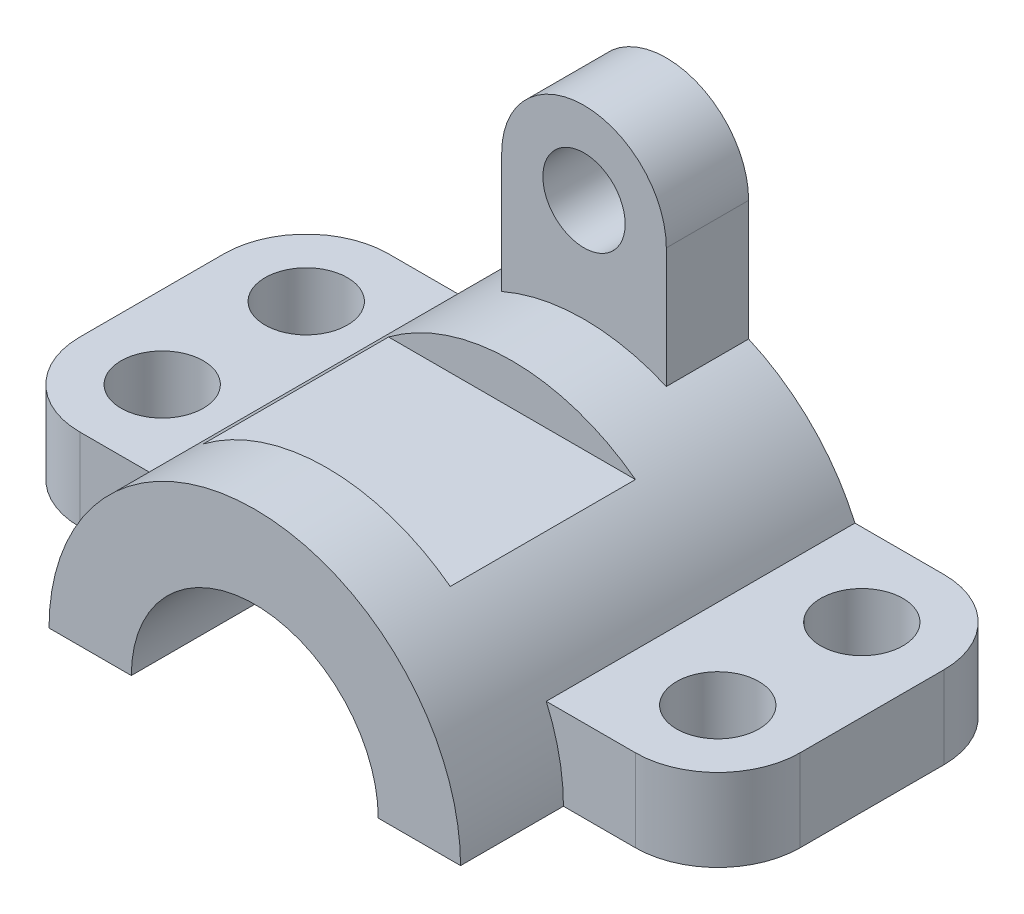
ISO-10303-21;
HEADER;
FILE_DESCRIPTION(('STEP AP214'),'2;1');
FILE_NAME('part.step','',(''),(''),'','','');
FILE_SCHEMA(('AUTOMOTIVE_DESIGN { 1 0 10303 214 1 1 1 1 }'));
ENDSEC;
DATA;
#1=APPLICATION_CONTEXT('core data for automotive mechanical design processes');
#2=APPLICATION_PROTOCOL_DEFINITION('international standard','automotive_design',2000,#1);
#3=PRODUCT_CONTEXT('',#1,'mechanical');
#4=PRODUCT('Part','Part','',(#3));
#5=PRODUCT_RELATED_PRODUCT_CATEGORY('part','',(#4));
#6=PRODUCT_DEFINITION_FORMATION('','',#4);
#7=PRODUCT_DEFINITION_CONTEXT('part definition',#1,'design');
#8=PRODUCT_DEFINITION('design','',#6,#7);
#9=PRODUCT_DEFINITION_SHAPE('','',#8);
#10=(LENGTH_UNIT() NAMED_UNIT(*) SI_UNIT(.MILLI.,.METRE.));
#11=(NAMED_UNIT(*) PLANE_ANGLE_UNIT() SI_UNIT($,.RADIAN.));
#12=(NAMED_UNIT(*) SI_UNIT($,.STERADIAN.) SOLID_ANGLE_UNIT());
#13=UNCERTAINTY_MEASURE_WITH_UNIT(LENGTH_MEASURE(1.E-05),#10,'distance_accuracy_value','');
#14=(GEOMETRIC_REPRESENTATION_CONTEXT(3) GLOBAL_UNCERTAINTY_ASSIGNED_CONTEXT((#13)) GLOBAL_UNIT_ASSIGNED_CONTEXT((#10,
#11,#12)) REPRESENTATION_CONTEXT('',''));
#15=CARTESIAN_POINT('',(0.,0.,0.));
#16=DIRECTION('',(0.,0.,1.));
#17=DIRECTION('',(1.,0.,0.));
#18=AXIS2_PLACEMENT_3D('',#15,#16,#17);
#19=CARTESIAN_POINT('',(0.,0.,80.));
#20=DIRECTION('',(0.,0.,-1.));
#21=DIRECTION('',(-1.,0.,0.));
#22=AXIS2_PLACEMENT_3D('',#19,#20,#21);
#23=CYLINDRICAL_SURFACE('',#22,40.);
#24=DIRECTION('',(0.,0.,-1.));
#25=VECTOR('',#24,1.);
#26=CARTESIAN_POINT('',(24.,32.,80.));
#27=LINE('',#26,#25);
#28=CARTESIAN_POINT('',(24.,32.,66.));
#29=VERTEX_POINT('',#28);
#30=CARTESIAN_POINT('',(24.,32.,30.));
#31=VERTEX_POINT('',#30);
#32=EDGE_CURVE('E42',#29,#31,#27,.T.);
#33=ORIENTED_EDGE('',*,*,#32,.F.);
#34=CARTESIAN_POINT('',(0.,0.,66.));
#35=DIRECTION('',(0.,0.,-1.));
#36=DIRECTION('',(-1.,0.,0.));
#37=AXIS2_PLACEMENT_3D('',#34,#35,#36);
#38=CIRCLE('',#37,40.);
#39=CARTESIAN_POINT('',(-24.,32.,66.));
#40=VERTEX_POINT('',#39);
#41=EDGE_CURVE('E336',#40,#29,#38,.T.);
#42=ORIENTED_EDGE('',*,*,#41,.F.);
#43=DIRECTION('',(0.,0.,-1.));
#44=VECTOR('',#43,1.);
#45=CARTESIAN_POINT('',(-24.,32.,80.));
#46=LINE('',#45,#44);
#47=CARTESIAN_POINT('',(-24.,32.,30.));
#48=VERTEX_POINT('',#47);
#49=EDGE_CURVE('E331',#48,#40,#46,.F.);
#50=ORIENTED_EDGE('',*,*,#49,.F.);
#51=CARTESIAN_POINT('',(0.,0.,30.));
#52=DIRECTION('',(0.,0.,1.));
#53=DIRECTION('',(1.,0.,0.));
#54=AXIS2_PLACEMENT_3D('',#51,#52,#53);
#55=CIRCLE('',#54,40.);
#56=EDGE_CURVE('E333',#31,#48,#55,.T.);
#57=ORIENTED_EDGE('',*,*,#56,.F.);
#58=EDGE_LOOP('',(#33,#42,#50,#57));
#59=FACE_BOUND('',#58,.T.);
#60=DIRECTION('',(0.,0.,-1.));
#61=VECTOR('',#60,1.);
#62=CARTESIAN_POINT('',(-16.,36.6606055596467,16.));
#63=LINE('',#62,#61);
#64=CARTESIAN_POINT('',(-16.,36.6606055596467,16.));
#65=VERTEX_POINT('',#64);
#66=CARTESIAN_POINT('',(-16.,36.6606055596467,0.));
#67=VERTEX_POINT('',#66);
#68=EDGE_CURVE('E174',#65,#67,#63,.T.);
#69=ORIENTED_EDGE('',*,*,#68,.T.);
#70=CARTESIAN_POINT('',(0.,0.,0.));
#71=DIRECTION('',(0.,0.,1.));
#72=DIRECTION('',(1.,0.,0.));
#73=AXIS2_PLACEMENT_3D('',#70,#71,#72);
#74=CIRCLE('',#73,40.);
#75=CARTESIAN_POINT('',(-36.6606055596467,16.,0.));
#76=VERTEX_POINT('',#75);
#77=EDGE_CURVE('E302',#67,#76,#74,.T.);
#78=ORIENTED_EDGE('',*,*,#77,.T.);
#79=DIRECTION('',(0.,0.,-1.));
#80=VECTOR('',#79,1.);
#81=CARTESIAN_POINT('',(-36.6606055596467,16.,80.));
#82=LINE('',#81,#80);
#83=CARTESIAN_POINT('',(-36.6606055596467,16.,60.));
#84=VERTEX_POINT('',#83);
#85=EDGE_CURVE('E246',#84,#76,#82,.T.);
#86=ORIENTED_EDGE('',*,*,#85,.F.);
#87=CARTESIAN_POINT('',(0.,0.,60.));
#88=DIRECTION('',(0.,0.,-1.));
#89=DIRECTION('',(-1.,0.,0.));
#90=AXIS2_PLACEMENT_3D('',#87,#88,#89);
#91=CIRCLE('',#90,40.);
#92=CARTESIAN_POINT('',(-40.,0.,60.));
#93=VERTEX_POINT('',#92);
#94=EDGE_CURVE('E249',#93,#84,#91,.T.);
#95=ORIENTED_EDGE('',*,*,#94,.F.);
#96=DIRECTION('',(0.,0.,-1.));
#97=VECTOR('',#96,1.);
#98=CARTESIAN_POINT('',(-40.,0.,80.));
#99=LINE('',#98,#97);
#100=CARTESIAN_POINT('',(-40.,0.,80.));
#101=VERTEX_POINT('',#100);
#102=EDGE_CURVE('E328',#101,#93,#99,.T.);
#103=ORIENTED_EDGE('',*,*,#102,.F.);
#104=CARTESIAN_POINT('',(0.,0.,80.));
#105=DIRECTION('',(0.,0.,1.));
#106=DIRECTION('',(1.,0.,0.));
#107=AXIS2_PLACEMENT_3D('',#104,#105,#106);
#108=CIRCLE('',#107,40.);
#109=CARTESIAN_POINT('',(40.,0.,80.));
#110=VERTEX_POINT('',#109);
#111=EDGE_CURVE('E303',#110,#101,#108,.T.);
#112=ORIENTED_EDGE('',*,*,#111,.F.);
#113=DIRECTION('',(0.,0.,-1.));
#114=VECTOR('',#113,1.);
#115=CARTESIAN_POINT('',(40.,0.,80.));
#116=LINE('',#115,#114);
#117=CARTESIAN_POINT('',(40.,0.,60.));
#118=VERTEX_POINT('',#117);
#119=EDGE_CURVE('E313',#110,#118,#116,.T.);
#120=ORIENTED_EDGE('',*,*,#119,.T.);
#121=CARTESIAN_POINT('',(0.,0.,60.));
#122=DIRECTION('',(0.,0.,-1.));
#123=DIRECTION('',(-1.,0.,0.));
#124=AXIS2_PLACEMENT_3D('',#121,#122,#123);
#125=CIRCLE('',#124,40.);
#126=CARTESIAN_POINT('',(36.6606055596467,16.,60.));
#127=VERTEX_POINT('',#126);
#128=EDGE_CURVE('E299',#127,#118,#125,.T.);
#129=ORIENTED_EDGE('',*,*,#128,.F.);
#130=DIRECTION('',(0.,0.,-1.));
#131=VECTOR('',#130,1.);
#132=CARTESIAN_POINT('',(36.6606055596467,16.,80.));
#133=LINE('',#132,#131);
#134=CARTESIAN_POINT('',(36.6606055596467,16.,0.));
#135=VERTEX_POINT('',#134);
#136=EDGE_CURVE('E296',#127,#135,#133,.T.);
#137=ORIENTED_EDGE('',*,*,#136,.T.);
#138=CARTESIAN_POINT('',(16.,36.6606055596467,0.));
#139=VERTEX_POINT('',#138);
#140=EDGE_CURVE('E314',#135,#139,#74,.T.);
#141=ORIENTED_EDGE('',*,*,#140,.T.);
#142=DIRECTION('',(0.,0.,-1.));
#143=VECTOR('',#142,1.);
#144=CARTESIAN_POINT('',(16.,36.6606055596467,16.));
#145=LINE('',#144,#143);
#146=CARTESIAN_POINT('',(16.,36.6606055596467,16.));
#147=VERTEX_POINT('',#146);
#148=EDGE_CURVE('E52',#147,#139,#145,.T.);
#149=ORIENTED_EDGE('',*,*,#148,.F.);
#150=CARTESIAN_POINT('',(0.,0.,16.));
#151=DIRECTION('',(0.,0.,1.));
#152=DIRECTION('',(1.,0.,0.));
#153=AXIS2_PLACEMENT_3D('',#150,#151,#152);
#154=CIRCLE('',#153,40.);
#155=EDGE_CURVE('E11',#147,#65,#154,.T.);
#156=ORIENTED_EDGE('',*,*,#155,.T.);
#157=EDGE_LOOP('',(#69,#78,#86,#95,#103,#112,#120,#129,#137,#141,#149,#156));
#158=FACE_BOUND('',#157,.T.);
#159=ADVANCED_FACE('F35',(#59,#158),#23,.T.);
#160=CARTESIAN_POINT('',(-40.,0.,80.));
#161=DIRECTION('',(0.,1.,0.));
#162=DIRECTION('',(0.,0.,1.));
#163=AXIS2_PLACEMENT_3D('',#160,#161,#162);
#164=PLANE('',#163);
#165=ORIENTED_EDGE('',*,*,#102,.T.);
#166=DIRECTION('',(1.,0.,0.));
#167=VECTOR('',#166,1.);
#168=CARTESIAN_POINT('',(-53.9999999999999,0.,60.));
#169=LINE('',#168,#167);
#170=CARTESIAN_POINT('',(-53.9999999999999,0.,60.));
#171=VERTEX_POINT('',#170);
#172=EDGE_CURVE('E217',#171,#93,#169,.T.);
#173=ORIENTED_EDGE('',*,*,#172,.F.);
#174=CARTESIAN_POINT('',(-54.,0.,44.));
#175=DIRECTION('',(0.,1.,0.));
#176=DIRECTION('',(0.,0.,1.));
#177=AXIS2_PLACEMENT_3D('',#174,#175,#176);
#178=CIRCLE('',#177,16.);
#179=CARTESIAN_POINT('',(-70.,0.,43.9999999999999));
#180=VERTEX_POINT('',#179);
#181=EDGE_CURVE('E231',#180,#171,#178,.T.);
#182=ORIENTED_EDGE('',*,*,#181,.F.);
#183=DIRECTION('',(0.,0.,1.));
#184=VECTOR('',#183,1.);
#185=CARTESIAN_POINT('',(-70.,0.,16.0000000000001));
#186=LINE('',#185,#184);
#187=CARTESIAN_POINT('',(-70.,0.,16.0000000000001));
#188=VERTEX_POINT('',#187);
#189=EDGE_CURVE('E229',#188,#180,#186,.T.);
#190=ORIENTED_EDGE('',*,*,#189,.F.);
#191=CARTESIAN_POINT('',(-54.,0.,16.));
#192=DIRECTION('',(0.,1.,0.));
#193=DIRECTION('',(0.,0.,-1.));
#194=AXIS2_PLACEMENT_3D('',#191,#192,#193);
#195=CIRCLE('',#194,16.);
#196=CARTESIAN_POINT('',(-53.9999999999999,0.,0.));
#197=VERTEX_POINT('',#196);
#198=EDGE_CURVE('E210',#197,#188,#195,.T.);
#199=ORIENTED_EDGE('',*,*,#198,.F.);
#200=DIRECTION('',(1.,0.,0.));
#201=VECTOR('',#200,1.);
#202=CARTESIAN_POINT('',(-40.,0.,0.));
#203=LINE('',#202,#201);
#204=CARTESIAN_POINT('',(-24.,0.,0.));
#205=VERTEX_POINT('',#204);
#206=EDGE_CURVE('E316',#197,#205,#203,.T.);
#207=ORIENTED_EDGE('',*,*,#206,.T.);
#208=DIRECTION('',(0.,0.,-1.));
#209=VECTOR('',#208,1.);
#210=CARTESIAN_POINT('',(-24.,0.,80.));
#211=LINE('',#210,#209);
#212=CARTESIAN_POINT('',(-24.,0.,80.));
#213=VERTEX_POINT('',#212);
#214=EDGE_CURVE('E325',#213,#205,#211,.T.);
#215=ORIENTED_EDGE('',*,*,#214,.F.);
#216=DIRECTION('',(1.,0.,0.));
#217=VECTOR('',#216,1.);
#218=CARTESIAN_POINT('',(-40.,0.,80.));
#219=LINE('',#218,#217);
#220=EDGE_CURVE('E306',#101,#213,#219,.T.);
#221=ORIENTED_EDGE('',*,*,#220,.F.);
#222=EDGE_LOOP('',(#165,#173,#182,#190,#199,#207,#215,#221));
#223=FACE_BOUND('',#222,.T.);
#224=CARTESIAN_POINT('',(-54.,0.,16.));
#225=DIRECTION('',(0.,1.,0.));
#226=DIRECTION('',(0.,0.,-1.));
#227=AXIS2_PLACEMENT_3D('',#224,#225,#226);
#228=CIRCLE('',#227,8.);
#229=CARTESIAN_POINT('',(-54.,0.,8.00000000000001));
#230=VERTEX_POINT('',#229);
#231=EDGE_CURVE('E200',#230,#230,#228,.T.);
#232=ORIENTED_EDGE('',*,*,#231,.T.);
#233=EDGE_LOOP('',(#232));
#234=FACE_BOUND('',#233,.T.);
#235=CARTESIAN_POINT('',(-54.,0.,44.));
#236=DIRECTION('',(0.,1.,0.));
#237=DIRECTION('',(0.,0.,-1.));
#238=AXIS2_PLACEMENT_3D('',#235,#236,#237);
#239=CIRCLE('',#238,8.);
#240=CARTESIAN_POINT('',(-54.,0.,36.));
#241=VERTEX_POINT('',#240);
#242=EDGE_CURVE('E204',#241,#241,#239,.T.);
#243=ORIENTED_EDGE('',*,*,#242,.T.);
#244=EDGE_LOOP('',(#243));
#245=FACE_BOUND('',#244,.T.);
#246=ADVANCED_FACE('F363',(#223,#234,#245),#164,.F.);
#247=CARTESIAN_POINT('',(0.,0.,80.));
#248=DIRECTION('',(0.,0.,-1.));
#249=DIRECTION('',(-1.,0.,0.));
#250=AXIS2_PLACEMENT_3D('',#247,#248,#249);
#251=CYLINDRICAL_SURFACE('',#250,24.);
#252=CARTESIAN_POINT('',(0.,0.,0.));
#253=DIRECTION('',(0.,0.,-1.));
#254=DIRECTION('',(1.,0.,0.));
#255=AXIS2_PLACEMENT_3D('',#252,#253,#254);
#256=CIRCLE('',#255,24.);
#257=CARTESIAN_POINT('',(24.,0.,0.));
#258=VERTEX_POINT('',#257);
#259=EDGE_CURVE('E318',#205,#258,#256,.T.);
#260=ORIENTED_EDGE('',*,*,#259,.T.);
#261=DIRECTION('',(0.,0.,-1.));
#262=VECTOR('',#261,1.);
#263=CARTESIAN_POINT('',(24.,0.,80.));
#264=LINE('',#263,#262);
#265=CARTESIAN_POINT('',(24.,0.,80.));
#266=VERTEX_POINT('',#265);
#267=EDGE_CURVE('E322',#266,#258,#264,.T.);
#268=ORIENTED_EDGE('',*,*,#267,.F.);
#269=CARTESIAN_POINT('',(0.,0.,80.));
#270=DIRECTION('',(0.,0.,-1.));
#271=DIRECTION('',(1.,0.,0.));
#272=AXIS2_PLACEMENT_3D('',#269,#270,#271);
#273=CIRCLE('',#272,24.);
#274=EDGE_CURVE('E309',#213,#266,#273,.T.);
#275=ORIENTED_EDGE('',*,*,#274,.F.);
#276=ORIENTED_EDGE('',*,*,#214,.T.);
#277=EDGE_LOOP('',(#260,#268,#275,#276));
#278=FACE_BOUND('',#277,.T.);
#279=ADVANCED_FACE('F369',(#278),#251,.F.);
#280=CARTESIAN_POINT('',(24.,0.,80.));
#281=DIRECTION('',(0.,1.,0.));
#282=DIRECTION('',(0.,0.,1.));
#283=AXIS2_PLACEMENT_3D('',#280,#281,#282);
#284=PLANE('',#283);
#285=DIRECTION('',(1.,0.,0.));
#286=VECTOR('',#285,1.);
#287=CARTESIAN_POINT('',(24.,0.,0.));
#288=LINE('',#287,#286);
#289=CARTESIAN_POINT('',(53.9999999999999,0.,0.));
#290=VERTEX_POINT('',#289);
#291=EDGE_CURVE('E307',#258,#290,#288,.T.);
#292=ORIENTED_EDGE('',*,*,#291,.T.);
#293=CARTESIAN_POINT('',(54.,0.,16.));
#294=DIRECTION('',(0.,1.,0.));
#295=DIRECTION('',(0.,0.,1.));
#296=AXIS2_PLACEMENT_3D('',#293,#294,#295);
#297=CIRCLE('',#296,16.);
#298=CARTESIAN_POINT('',(70.,0.,16.0000000000001));
#299=VERTEX_POINT('',#298);
#300=EDGE_CURVE('E268',#299,#290,#297,.T.);
#301=ORIENTED_EDGE('',*,*,#300,.F.);
#302=DIRECTION('',(0.,0.,-1.));
#303=VECTOR('',#302,1.);
#304=CARTESIAN_POINT('',(70.,0.,16.0000000000001));
#305=LINE('',#304,#303);
#306=CARTESIAN_POINT('',(70.,0.,43.9999999999999));
#307=VERTEX_POINT('',#306);
#308=EDGE_CURVE('E281',#307,#299,#305,.T.);
#309=ORIENTED_EDGE('',*,*,#308,.F.);
#310=CARTESIAN_POINT('',(54.,0.,44.));
#311=DIRECTION('',(0.,1.,0.));
#312=DIRECTION('',(0.,0.,-1.));
#313=AXIS2_PLACEMENT_3D('',#310,#311,#312);
#314=CIRCLE('',#313,16.);
#315=CARTESIAN_POINT('',(53.9999999999999,0.,60.));
#316=VERTEX_POINT('',#315);
#317=EDGE_CURVE('E279',#316,#307,#314,.T.);
#318=ORIENTED_EDGE('',*,*,#317,.F.);
#319=DIRECTION('',(1.,0.,0.));
#320=VECTOR('',#319,1.);
#321=CARTESIAN_POINT('',(53.9999999999999,0.,60.));
#322=LINE('',#321,#320);
#323=EDGE_CURVE('E262',#118,#316,#322,.T.);
#324=ORIENTED_EDGE('',*,*,#323,.F.);
#325=ORIENTED_EDGE('',*,*,#119,.F.);
#326=DIRECTION('',(1.,0.,0.));
#327=VECTOR('',#326,1.);
#328=CARTESIAN_POINT('',(24.,0.,80.));
#329=LINE('',#328,#327);
#330=EDGE_CURVE('E311',#266,#110,#329,.T.);
#331=ORIENTED_EDGE('',*,*,#330,.F.);
#332=ORIENTED_EDGE('',*,*,#267,.T.);
#333=EDGE_LOOP('',(#292,#301,#309,#318,#324,#325,#331,#332));
#334=FACE_BOUND('',#333,.T.);
#335=CARTESIAN_POINT('',(54.,0.,16.));
#336=DIRECTION('',(0.,1.,0.));
#337=DIRECTION('',(0.,0.,1.));
#338=AXIS2_PLACEMENT_3D('',#335,#336,#337);
#339=CIRCLE('',#338,8.);
#340=CARTESIAN_POINT('',(54.,0.,24.));
#341=VERTEX_POINT('',#340);
#342=EDGE_CURVE('E256',#341,#341,#339,.T.);
#343=ORIENTED_EDGE('',*,*,#342,.T.);
#344=EDGE_LOOP('',(#343));
#345=FACE_BOUND('',#344,.T.);
#346=CARTESIAN_POINT('',(54.,0.,44.));
#347=DIRECTION('',(0.,1.,0.));
#348=DIRECTION('',(0.,0.,1.));
#349=AXIS2_PLACEMENT_3D('',#346,#347,#348);
#350=CIRCLE('',#349,8.);
#351=CARTESIAN_POINT('',(54.,0.,52.));
#352=VERTEX_POINT('',#351);
#353=EDGE_CURVE('E252',#352,#352,#350,.T.);
#354=ORIENTED_EDGE('',*,*,#353,.T.);
#355=EDGE_LOOP('',(#354));
#356=FACE_BOUND('',#355,.T.);
#357=ADVANCED_FACE('F374',(#334,#345,#356),#284,.F.);
#358=CARTESIAN_POINT('',(0.,0.,80.));
#359=DIRECTION('',(0.,0.,1.));
#360=DIRECTION('',(1.,0.,0.));
#361=AXIS2_PLACEMENT_3D('',#358,#359,#360);
#362=PLANE('',#361);
#363=ORIENTED_EDGE('',*,*,#111,.T.);
#364=ORIENTED_EDGE('',*,*,#220,.T.);
#365=ORIENTED_EDGE('',*,*,#274,.T.);
#366=ORIENTED_EDGE('',*,*,#330,.T.);
#367=EDGE_LOOP('',(#363,#364,#365,#366));
#368=FACE_BOUND('',#367,.T.);
#369=ADVANCED_FACE('F381',(#368),#362,.T.);
#370=CARTESIAN_POINT('',(0.,0.,0.));
#371=DIRECTION('',(0.,0.,1.));
#372=DIRECTION('',(1.,0.,0.));
#373=AXIS2_PLACEMENT_3D('',#370,#371,#372);
#374=PLANE('',#373);
#375=ORIENTED_EDGE('',*,*,#77,.F.);
#376=DIRECTION('',(0.,-1.,0.));
#377=VECTOR('',#376,1.);
#378=CARTESIAN_POINT('',(-16.,60.,0.));
#379=LINE('',#378,#377);
#380=CARTESIAN_POINT('',(-16.,60.,0.));
#381=VERTEX_POINT('',#380);
#382=EDGE_CURVE('E482',#381,#67,#379,.T.);
#383=ORIENTED_EDGE('',*,*,#382,.F.);
#384=CARTESIAN_POINT('',(0.,60.,0.));
#385=DIRECTION('',(0.,0.,1.));
#386=DIRECTION('',(1.,0.,0.));
#387=AXIS2_PLACEMENT_3D('',#384,#385,#386);
#388=CIRCLE('',#387,16.);
#389=CARTESIAN_POINT('',(16.,60.,0.));
#390=VERTEX_POINT('',#389);
#391=EDGE_CURVE('E190',#390,#381,#388,.T.);
#392=ORIENTED_EDGE('',*,*,#391,.F.);
#393=DIRECTION('',(0.,1.,0.));
#394=VECTOR('',#393,1.);
#395=CARTESIAN_POINT('',(16.,60.,0.));
#396=LINE('',#395,#394);
#397=EDGE_CURVE('E186',#139,#390,#396,.T.);
#398=ORIENTED_EDGE('',*,*,#397,.F.);
#399=ORIENTED_EDGE('',*,*,#140,.F.);
#400=DIRECTION('',(-1.,0.,0.));
#401=VECTOR('',#400,1.);
#402=CARTESIAN_POINT('',(32.9517303575973,16.,0.));
#403=LINE('',#402,#401);
#404=CARTESIAN_POINT('',(53.9999999999999,16.,0.));
#405=VERTEX_POINT('',#404);
#406=EDGE_CURVE('E274',#405,#135,#403,.T.);
#407=ORIENTED_EDGE('',*,*,#406,.F.);
#408=DIRECTION('',(0.,-1.,0.));
#409=VECTOR('',#408,1.);
#410=CARTESIAN_POINT('',(53.9999999999999,16.,0.));
#411=LINE('',#410,#409);
#412=EDGE_CURVE('E277',#405,#290,#411,.T.);
#413=ORIENTED_EDGE('',*,*,#412,.T.);
#414=ORIENTED_EDGE('',*,*,#291,.F.);
#415=ORIENTED_EDGE('',*,*,#259,.F.);
#416=ORIENTED_EDGE('',*,*,#206,.F.);
#417=DIRECTION('',(0.,-1.,0.));
#418=VECTOR('',#417,1.);
#419=CARTESIAN_POINT('',(-53.9999999999999,16.,0.));
#420=LINE('',#419,#418);
#421=CARTESIAN_POINT('',(-53.9999999999999,16.,0.));
#422=VERTEX_POINT('',#421);
#423=EDGE_CURVE('E226',#422,#197,#420,.T.);
#424=ORIENTED_EDGE('',*,*,#423,.F.);
#425=DIRECTION('',(-1.,0.,0.));
#426=VECTOR('',#425,1.);
#427=CARTESIAN_POINT('',(-32.9517303575973,16.,0.));
#428=LINE('',#427,#426);
#429=EDGE_CURVE('E224',#76,#422,#428,.T.);
#430=ORIENTED_EDGE('',*,*,#429,.F.);
#431=EDGE_LOOP('',(#375,#383,#392,#398,#399,#407,#413,#414,#415,#416,#424,#430));
#432=FACE_BOUND('',#431,.T.);
#433=CARTESIAN_POINT('',(0.,60.,0.));
#434=DIRECTION('',(0.,0.,1.));
#435=DIRECTION('',(1.,0.,0.));
#436=AXIS2_PLACEMENT_3D('',#433,#434,#435);
#437=CIRCLE('',#436,8.);
#438=CARTESIAN_POINT('',(8.,60.,0.));
#439=VERTEX_POINT('',#438);
#440=EDGE_CURVE('E490',#439,#439,#437,.T.);
#441=ORIENTED_EDGE('',*,*,#440,.T.);
#442=EDGE_LOOP('',(#441));
#443=FACE_BOUND('',#442,.T.);
#444=ADVANCED_FACE('F383',(#432,#443),#374,.F.);
#445=CARTESIAN_POINT('',(53.9999999999999,16.,60.));
#446=DIRECTION('',(0.,0.,-1.));
#447=DIRECTION('',(-1.,0.,0.));
#448=AXIS2_PLACEMENT_3D('',#445,#446,#447);
#449=PLANE('',#448);
#450=DIRECTION('',(1.,0.,0.));
#451=VECTOR('',#450,1.);
#452=CARTESIAN_POINT('',(53.9999999999999,16.,60.));
#453=LINE('',#452,#451);
#454=CARTESIAN_POINT('',(53.9999999999999,16.,60.));
#455=VERTEX_POINT('',#454);
#456=EDGE_CURVE('E265',#127,#455,#453,.T.);
#457=ORIENTED_EDGE('',*,*,#456,.F.);
#458=ORIENTED_EDGE('',*,*,#128,.T.);
#459=ORIENTED_EDGE('',*,*,#323,.T.);
#460=DIRECTION('',(0.,-1.,0.));
#461=VECTOR('',#460,1.);
#462=CARTESIAN_POINT('',(53.9999999999999,16.,60.));
#463=LINE('',#462,#461);
#464=EDGE_CURVE('E293',#455,#316,#463,.T.);
#465=ORIENTED_EDGE('',*,*,#464,.F.);
#466=EDGE_LOOP('',(#457,#458,#459,#465));
#467=FACE_BOUND('',#466,.T.);
#468=ADVANCED_FACE('F385',(#467),#449,.F.);
#469=CARTESIAN_POINT('',(54.,16.,16.));
#470=DIRECTION('',(0.,1.,0.));
#471=DIRECTION('',(0.,0.,1.));
#472=AXIS2_PLACEMENT_3D('',#469,#470,#471);
#473=PLANE('',#472);
#474=CARTESIAN_POINT('',(54.,16.,44.));
#475=DIRECTION('',(0.,1.,0.));
#476=DIRECTION('',(0.,0.,1.));
#477=AXIS2_PLACEMENT_3D('',#474,#475,#476);
#478=CIRCLE('',#477,8.);
#479=CARTESIAN_POINT('',(54.,16.,52.));
#480=VERTEX_POINT('',#479);
#481=EDGE_CURVE('E253',#480,#480,#478,.T.);
#482=ORIENTED_EDGE('',*,*,#481,.F.);
#483=EDGE_LOOP('',(#482));
#484=FACE_BOUND('',#483,.T.);
#485=CARTESIAN_POINT('',(54.,16.,16.));
#486=DIRECTION('',(0.,1.,0.));
#487=DIRECTION('',(0.,0.,1.));
#488=AXIS2_PLACEMENT_3D('',#485,#486,#487);
#489=CIRCLE('',#488,8.);
#490=CARTESIAN_POINT('',(54.,16.,24.));
#491=VERTEX_POINT('',#490);
#492=EDGE_CURVE('E259',#491,#491,#489,.T.);
#493=ORIENTED_EDGE('',*,*,#492,.F.);
#494=EDGE_LOOP('',(#493));
#495=FACE_BOUND('',#494,.T.);
#496=ORIENTED_EDGE('',*,*,#136,.F.);
#497=ORIENTED_EDGE('',*,*,#456,.T.);
#498=CARTESIAN_POINT('',(54.,16.,44.));
#499=DIRECTION('',(0.,1.,0.));
#500=DIRECTION('',(0.,0.,-1.));
#501=AXIS2_PLACEMENT_3D('',#498,#499,#500);
#502=CIRCLE('',#501,16.);
#503=CARTESIAN_POINT('',(70.,16.,43.9999999999999));
#504=VERTEX_POINT('',#503);
#505=EDGE_CURVE('E267',#455,#504,#502,.T.);
#506=ORIENTED_EDGE('',*,*,#505,.T.);
#507=DIRECTION('',(0.,0.,-1.));
#508=VECTOR('',#507,1.);
#509=CARTESIAN_POINT('',(70.,16.,16.0000000000001));
#510=LINE('',#509,#508);
#511=CARTESIAN_POINT('',(70.,16.,16.0000000000001));
#512=VERTEX_POINT('',#511);
#513=EDGE_CURVE('E270',#504,#512,#510,.T.);
#514=ORIENTED_EDGE('',*,*,#513,.T.);
#515=CARTESIAN_POINT('',(54.,16.,16.));
#516=DIRECTION('',(0.,1.,0.));
#517=DIRECTION('',(0.,0.,1.));
#518=AXIS2_PLACEMENT_3D('',#515,#516,#517);
#519=CIRCLE('',#518,16.);
#520=EDGE_CURVE('E272',#512,#405,#519,.T.);
#521=ORIENTED_EDGE('',*,*,#520,.T.);
#522=ORIENTED_EDGE('',*,*,#406,.T.);
#523=EDGE_LOOP('',(#496,#497,#506,#514,#521,#522));
#524=FACE_BOUND('',#523,.T.);
#525=ADVANCED_FACE('F392',(#484,#495,#524),#473,.T.);
#526=CARTESIAN_POINT('',(54.,16.,44.));
#527=DIRECTION('',(0.,-1.,0.));
#528=DIRECTION('',(0.,0.,-1.));
#529=AXIS2_PLACEMENT_3D('',#526,#527,#528);
#530=CYLINDRICAL_SURFACE('',#529,16.);
#531=ORIENTED_EDGE('',*,*,#317,.T.);
#532=DIRECTION('',(0.,-1.,0.));
#533=VECTOR('',#532,1.);
#534=CARTESIAN_POINT('',(70.,16.,43.9999999999999));
#535=LINE('',#534,#533);
#536=EDGE_CURVE('E290',#504,#307,#535,.T.);
#537=ORIENTED_EDGE('',*,*,#536,.F.);
#538=ORIENTED_EDGE('',*,*,#505,.F.);
#539=ORIENTED_EDGE('',*,*,#464,.T.);
#540=EDGE_LOOP('',(#531,#537,#538,#539));
#541=FACE_BOUND('',#540,.T.);
#542=ADVANCED_FACE('F394',(#541),#530,.T.);
#543=CARTESIAN_POINT('',(70.,16.,16.0000000000001));
#544=DIRECTION('',(-1.,0.,0.));
#545=DIRECTION('',(0.,0.,1.));
#546=AXIS2_PLACEMENT_3D('',#543,#544,#545);
#547=PLANE('',#546);
#548=ORIENTED_EDGE('',*,*,#308,.T.);
#549=DIRECTION('',(0.,-1.,0.));
#550=VECTOR('',#549,1.);
#551=CARTESIAN_POINT('',(70.,16.,16.0000000000001));
#552=LINE('',#551,#550);
#553=EDGE_CURVE('E287',#512,#299,#552,.T.);
#554=ORIENTED_EDGE('',*,*,#553,.F.);
#555=ORIENTED_EDGE('',*,*,#513,.F.);
#556=ORIENTED_EDGE('',*,*,#536,.T.);
#557=EDGE_LOOP('',(#548,#554,#555,#556));
#558=FACE_BOUND('',#557,.T.);
#559=ADVANCED_FACE('F397',(#558),#547,.F.);
#560=CARTESIAN_POINT('',(54.,16.,16.));
#561=DIRECTION('',(0.,-1.,0.));
#562=DIRECTION('',(0.,0.,-1.));
#563=AXIS2_PLACEMENT_3D('',#560,#561,#562);
#564=CYLINDRICAL_SURFACE('',#563,16.);
#565=ORIENTED_EDGE('',*,*,#300,.T.);
#566=ORIENTED_EDGE('',*,*,#412,.F.);
#567=ORIENTED_EDGE('',*,*,#520,.F.);
#568=ORIENTED_EDGE('',*,*,#553,.T.);
#569=EDGE_LOOP('',(#565,#566,#567,#568));
#570=FACE_BOUND('',#569,.T.);
#571=ADVANCED_FACE('F401',(#570),#564,.T.);
#572=CARTESIAN_POINT('',(54.,16.,16.));
#573=DIRECTION('',(0.,-1.,0.));
#574=DIRECTION('',(0.,0.,-1.));
#575=AXIS2_PLACEMENT_3D('',#572,#573,#574);
#576=CYLINDRICAL_SURFACE('',#575,8.);
#577=ORIENTED_EDGE('',*,*,#492,.T.);
#578=EDGE_LOOP('',(#577));
#579=FACE_BOUND('',#578,.T.);
#580=ORIENTED_EDGE('',*,*,#342,.F.);
#581=EDGE_LOOP('',(#580));
#582=FACE_BOUND('',#581,.T.);
#583=ADVANCED_FACE('F405',(#579,#582),#576,.F.);
#584=CARTESIAN_POINT('',(54.,16.,44.));
#585=DIRECTION('',(0.,-1.,0.));
#586=DIRECTION('',(0.,0.,-1.));
#587=AXIS2_PLACEMENT_3D('',#584,#585,#586);
#588=CYLINDRICAL_SURFACE('',#587,8.);
#589=ORIENTED_EDGE('',*,*,#481,.T.);
#590=EDGE_LOOP('',(#589));
#591=FACE_BOUND('',#590,.T.);
#592=ORIENTED_EDGE('',*,*,#353,.F.);
#593=EDGE_LOOP('',(#592));
#594=FACE_BOUND('',#593,.T.);
#595=ADVANCED_FACE('F412',(#591,#594),#588,.F.);
#596=CARTESIAN_POINT('',(-53.9999999999999,16.,60.));
#597=DIRECTION('',(0.,0.,-1.));
#598=DIRECTION('',(-1.,0.,0.));
#599=AXIS2_PLACEMENT_3D('',#596,#597,#598);
#600=PLANE('',#599);
#601=ORIENTED_EDGE('',*,*,#172,.T.);
#602=ORIENTED_EDGE('',*,*,#94,.T.);
#603=DIRECTION('',(1.,0.,0.));
#604=VECTOR('',#603,1.);
#605=CARTESIAN_POINT('',(-53.9999999999999,16.,60.));
#606=LINE('',#605,#604);
#607=CARTESIAN_POINT('',(-53.9999999999999,16.,60.));
#608=VERTEX_POINT('',#607);
#609=EDGE_CURVE('E221',#608,#84,#606,.T.);
#610=ORIENTED_EDGE('',*,*,#609,.F.);
#611=DIRECTION('',(0.,-1.,0.));
#612=VECTOR('',#611,1.);
#613=CARTESIAN_POINT('',(-53.9999999999999,16.,60.));
#614=LINE('',#613,#612);
#615=EDGE_CURVE('E237',#608,#171,#614,.T.);
#616=ORIENTED_EDGE('',*,*,#615,.T.);
#617=EDGE_LOOP('',(#601,#602,#610,#616));
#618=FACE_BOUND('',#617,.T.);
#619=ADVANCED_FACE('F416',(#618),#600,.F.);
#620=CARTESIAN_POINT('',(-54.,16.,16.));
#621=DIRECTION('',(0.,-1.,0.));
#622=DIRECTION('',(0.,0.,-1.));
#623=AXIS2_PLACEMENT_3D('',#620,#621,#622);
#624=PLANE('',#623);
#625=CARTESIAN_POINT('',(-54.,16.,44.));
#626=DIRECTION('',(0.,1.,0.));
#627=DIRECTION('',(0.,0.,-1.));
#628=AXIS2_PLACEMENT_3D('',#625,#626,#627);
#629=CIRCLE('',#628,8.);
#630=CARTESIAN_POINT('',(-54.,16.,36.));
#631=VERTEX_POINT('',#630);
#632=EDGE_CURVE('E207',#631,#631,#629,.T.);
#633=ORIENTED_EDGE('',*,*,#632,.F.);
#634=EDGE_LOOP('',(#633));
#635=FACE_BOUND('',#634,.T.);
#636=CARTESIAN_POINT('',(-54.,16.,16.));
#637=DIRECTION('',(0.,1.,0.));
#638=DIRECTION('',(0.,0.,-1.));
#639=AXIS2_PLACEMENT_3D('',#636,#637,#638);
#640=CIRCLE('',#639,8.);
#641=CARTESIAN_POINT('',(-54.,16.,8.00000000000001));
#642=VERTEX_POINT('',#641);
#643=EDGE_CURVE('E201',#642,#642,#640,.T.);
#644=ORIENTED_EDGE('',*,*,#643,.F.);
#645=EDGE_LOOP('',(#644));
#646=FACE_BOUND('',#645,.T.);
#647=ORIENTED_EDGE('',*,*,#609,.T.);
#648=ORIENTED_EDGE('',*,*,#85,.T.);
#649=ORIENTED_EDGE('',*,*,#429,.T.);
#650=CARTESIAN_POINT('',(-54.,16.,16.));
#651=DIRECTION('',(0.,1.,0.));
#652=DIRECTION('',(0.,0.,-1.));
#653=AXIS2_PLACEMENT_3D('',#650,#651,#652);
#654=CIRCLE('',#653,16.);
#655=CARTESIAN_POINT('',(-70.,16.,16.0000000000001));
#656=VERTEX_POINT('',#655);
#657=EDGE_CURVE('E213',#422,#656,#654,.T.);
#658=ORIENTED_EDGE('',*,*,#657,.T.);
#659=DIRECTION('',(0.,0.,1.));
#660=VECTOR('',#659,1.);
#661=CARTESIAN_POINT('',(-70.,16.,16.0000000000001));
#662=LINE('',#661,#660);
#663=CARTESIAN_POINT('',(-70.,16.,43.9999999999999));
#664=VERTEX_POINT('',#663);
#665=EDGE_CURVE('E216',#656,#664,#662,.T.);
#666=ORIENTED_EDGE('',*,*,#665,.T.);
#667=CARTESIAN_POINT('',(-54.,16.,44.));
#668=DIRECTION('',(0.,1.,0.));
#669=DIRECTION('',(0.,0.,1.));
#670=AXIS2_PLACEMENT_3D('',#667,#668,#669);
#671=CIRCLE('',#670,16.);
#672=EDGE_CURVE('E219',#664,#608,#671,.T.);
#673=ORIENTED_EDGE('',*,*,#672,.T.);
#674=EDGE_LOOP('',(#647,#648,#649,#658,#666,#673));
#675=FACE_BOUND('',#674,.T.);
#676=ADVANCED_FACE('F422',(#635,#646,#675),#624,.F.);
#677=CARTESIAN_POINT('',(-54.,16.,16.));
#678=DIRECTION('',(0.,-1.,0.));
#679=DIRECTION('',(0.,0.,-1.));
#680=AXIS2_PLACEMENT_3D('',#677,#678,#679);
#681=CYLINDRICAL_SURFACE('',#680,16.);
#682=ORIENTED_EDGE('',*,*,#198,.T.);
#683=DIRECTION('',(0.,-1.,0.));
#684=VECTOR('',#683,1.);
#685=CARTESIAN_POINT('',(-70.,16.,16.0000000000001));
#686=LINE('',#685,#684);
#687=EDGE_CURVE('E243',#656,#188,#686,.T.);
#688=ORIENTED_EDGE('',*,*,#687,.F.);
#689=ORIENTED_EDGE('',*,*,#657,.F.);
#690=ORIENTED_EDGE('',*,*,#423,.T.);
#691=EDGE_LOOP('',(#682,#688,#689,#690));
#692=FACE_BOUND('',#691,.T.);
#693=ADVANCED_FACE('F418',(#692),#681,.T.);
#694=CARTESIAN_POINT('',(-70.,16.,16.0000000000001));
#695=DIRECTION('',(1.,0.,0.));
#696=DIRECTION('',(0.,0.,-1.));
#697=AXIS2_PLACEMENT_3D('',#694,#695,#696);
#698=PLANE('',#697);
#699=ORIENTED_EDGE('',*,*,#189,.T.);
#700=DIRECTION('',(0.,-1.,0.));
#701=VECTOR('',#700,1.);
#702=CARTESIAN_POINT('',(-70.,16.,43.9999999999999));
#703=LINE('',#702,#701);
#704=EDGE_CURVE('E240',#664,#180,#703,.T.);
#705=ORIENTED_EDGE('',*,*,#704,.F.);
#706=ORIENTED_EDGE('',*,*,#665,.F.);
#707=ORIENTED_EDGE('',*,*,#687,.T.);
#708=EDGE_LOOP('',(#699,#705,#706,#707));
#709=FACE_BOUND('',#708,.T.);
#710=ADVANCED_FACE('F421',(#709),#698,.F.);
#711=CARTESIAN_POINT('',(-54.,16.,44.));
#712=DIRECTION('',(0.,-1.,0.));
#713=DIRECTION('',(0.,0.,-1.));
#714=AXIS2_PLACEMENT_3D('',#711,#712,#713);
#715=CYLINDRICAL_SURFACE('',#714,16.);
#716=ORIENTED_EDGE('',*,*,#181,.T.);
#717=ORIENTED_EDGE('',*,*,#615,.F.);
#718=ORIENTED_EDGE('',*,*,#672,.F.);
#719=ORIENTED_EDGE('',*,*,#704,.T.);
#720=EDGE_LOOP('',(#716,#717,#718,#719));
#721=FACE_BOUND('',#720,.T.);
#722=ADVANCED_FACE('F426',(#721),#715,.T.);
#723=CARTESIAN_POINT('',(-54.,16.,44.));
#724=DIRECTION('',(0.,-1.,0.));
#725=DIRECTION('',(0.,0.,-1.));
#726=AXIS2_PLACEMENT_3D('',#723,#724,#725);
#727=CYLINDRICAL_SURFACE('',#726,8.);
#728=ORIENTED_EDGE('',*,*,#632,.T.);
#729=EDGE_LOOP('',(#728));
#730=FACE_BOUND('',#729,.T.);
#731=ORIENTED_EDGE('',*,*,#242,.F.);
#732=EDGE_LOOP('',(#731));
#733=FACE_BOUND('',#732,.T.);
#734=ADVANCED_FACE('F359',(#730,#733),#727,.F.);
#735=CARTESIAN_POINT('',(-54.,16.,16.));
#736=DIRECTION('',(0.,-1.,0.));
#737=DIRECTION('',(0.,0.,-1.));
#738=AXIS2_PLACEMENT_3D('',#735,#736,#737);
#739=CYLINDRICAL_SURFACE('',#738,8.);
#740=ORIENTED_EDGE('',*,*,#643,.T.);
#741=EDGE_LOOP('',(#740));
#742=FACE_BOUND('',#741,.T.);
#743=ORIENTED_EDGE('',*,*,#231,.F.);
#744=EDGE_LOOP('',(#743));
#745=FACE_BOUND('',#744,.T.);
#746=ADVANCED_FACE('F351',(#742,#745),#739,.F.);
#747=CARTESIAN_POINT('',(-41.2842061868582,65.,66.));
#748=DIRECTION('',(0.,0.,-1.));
#749=DIRECTION('',(-1.,0.,0.));
#750=AXIS2_PLACEMENT_3D('',#747,#748,#749);
#751=PLANE('',#750);
#752=ORIENTED_EDGE('',*,*,#41,.T.);
#753=DIRECTION('',(1.,0.,0.));
#754=VECTOR('',#753,1.);
#755=CARTESIAN_POINT('',(-41.2842061868582,32.,66.));
#756=LINE('',#755,#754);
#757=EDGE_CURVE('E191',#40,#29,#756,.T.);
#758=ORIENTED_EDGE('',*,*,#757,.F.);
#759=EDGE_LOOP('',(#752,#758));
#760=FACE_BOUND('',#759,.T.);
#761=ADVANCED_FACE('F349',(#760),#751,.T.);
#762=CARTESIAN_POINT('',(-41.2842061868582,65.,30.));
#763=DIRECTION('',(0.,0.,1.));
#764=DIRECTION('',(1.,0.,0.));
#765=AXIS2_PLACEMENT_3D('',#762,#763,#764);
#766=PLANE('',#765);
#767=ORIENTED_EDGE('',*,*,#56,.T.);
#768=DIRECTION('',(-1.,0.,0.));
#769=VECTOR('',#768,1.);
#770=CARTESIAN_POINT('',(-41.2842061868582,32.,30.));
#771=LINE('',#770,#769);
#772=EDGE_CURVE('E194',#31,#48,#771,.T.);
#773=ORIENTED_EDGE('',*,*,#772,.F.);
#774=EDGE_LOOP('',(#767,#773));
#775=FACE_BOUND('',#774,.T.);
#776=ADVANCED_FACE('F346',(#775),#766,.T.);
#777=CARTESIAN_POINT('',(0.,32.,0.));
#778=DIRECTION('',(0.,1.,0.));
#779=DIRECTION('',(0.,0.,1.));
#780=AXIS2_PLACEMENT_3D('',#777,#778,#779);
#781=PLANE('',#780);
#782=ORIENTED_EDGE('',*,*,#32,.T.);
#783=ORIENTED_EDGE('',*,*,#772,.T.);
#784=ORIENTED_EDGE('',*,*,#49,.T.);
#785=ORIENTED_EDGE('',*,*,#757,.T.);
#786=EDGE_LOOP('',(#782,#783,#784,#785));
#787=FACE_BOUND('',#786,.T.);
#788=ADVANCED_FACE('F340',(#787),#781,.T.);
#789=CARTESIAN_POINT('',(0.,60.,16.));
#790=DIRECTION('',(0.,0.,1.));
#791=DIRECTION('',(1.,0.,0.));
#792=AXIS2_PLACEMENT_3D('',#789,#790,#791);
#793=PLANE('',#792);
#794=ORIENTED_EDGE('',*,*,#155,.F.);
#795=DIRECTION('',(0.,1.,0.));
#796=VECTOR('',#795,1.);
#797=CARTESIAN_POINT('',(16.,60.,16.));
#798=LINE('',#797,#796);
#799=CARTESIAN_POINT('',(16.,60.,16.));
#800=VERTEX_POINT('',#799);
#801=EDGE_CURVE('E176',#147,#800,#798,.T.);
#802=ORIENTED_EDGE('',*,*,#801,.T.);
#803=CARTESIAN_POINT('',(0.,60.,16.));
#804=DIRECTION('',(0.,0.,1.));
#805=DIRECTION('',(1.,0.,0.));
#806=AXIS2_PLACEMENT_3D('',#803,#804,#805);
#807=CIRCLE('',#806,16.);
#808=CARTESIAN_POINT('',(-16.,60.,16.));
#809=VERTEX_POINT('',#808);
#810=EDGE_CURVE('E177',#800,#809,#807,.T.);
#811=ORIENTED_EDGE('',*,*,#810,.T.);
#812=DIRECTION('',(0.,-1.,0.));
#813=VECTOR('',#812,1.);
#814=CARTESIAN_POINT('',(-16.,60.,16.));
#815=LINE('',#814,#813);
#816=EDGE_CURVE('E167',#809,#65,#815,.T.);
#817=ORIENTED_EDGE('',*,*,#816,.T.);
#818=EDGE_LOOP('',(#794,#802,#811,#817));
#819=FACE_BOUND('',#818,.T.);
#820=CARTESIAN_POINT('',(0.,60.,16.));
#821=DIRECTION('',(0.,0.,1.));
#822=DIRECTION('',(1.,0.,0.));
#823=AXIS2_PLACEMENT_3D('',#820,#821,#822);
#824=CIRCLE('',#823,8.);
#825=CARTESIAN_POINT('',(8.,60.,16.));
#826=VERTEX_POINT('',#825);
#827=EDGE_CURVE('E488',#826,#826,#824,.T.);
#828=ORIENTED_EDGE('',*,*,#827,.F.);
#829=EDGE_LOOP('',(#828));
#830=FACE_BOUND('',#829,.T.);
#831=ADVANCED_FACE('F180',(#819,#830),#793,.T.);
#832=CARTESIAN_POINT('',(0.,60.,16.));
#833=DIRECTION('',(0.,0.,-1.));
#834=DIRECTION('',(-1.,0.,0.));
#835=AXIS2_PLACEMENT_3D('',#832,#833,#834);
#836=CYLINDRICAL_SURFACE('',#835,16.);
#837=ORIENTED_EDGE('',*,*,#391,.T.);
#838=DIRECTION('',(0.,0.,-1.));
#839=VECTOR('',#838,1.);
#840=CARTESIAN_POINT('',(-16.,60.,16.));
#841=LINE('',#840,#839);
#842=EDGE_CURVE('E172',#809,#381,#841,.T.);
#843=ORIENTED_EDGE('',*,*,#842,.F.);
#844=ORIENTED_EDGE('',*,*,#810,.F.);
#845=DIRECTION('',(0.,0.,-1.));
#846=VECTOR('',#845,1.);
#847=CARTESIAN_POINT('',(16.,60.,16.));
#848=LINE('',#847,#846);
#849=EDGE_CURVE('E479',#800,#390,#848,.T.);
#850=ORIENTED_EDGE('',*,*,#849,.T.);
#851=EDGE_LOOP('',(#837,#843,#844,#850));
#852=FACE_BOUND('',#851,.T.);
#853=ADVANCED_FACE('F188',(#852),#836,.T.);
#854=CARTESIAN_POINT('',(-16.,60.,16.));
#855=DIRECTION('',(1.,0.,0.));
#856=DIRECTION('',(0.,0.,-1.));
#857=AXIS2_PLACEMENT_3D('',#854,#855,#856);
#858=PLANE('',#857);
#859=ORIENTED_EDGE('',*,*,#382,.T.);
#860=ORIENTED_EDGE('',*,*,#68,.F.);
#861=ORIENTED_EDGE('',*,*,#816,.F.);
#862=ORIENTED_EDGE('',*,*,#842,.T.);
#863=EDGE_LOOP('',(#859,#860,#861,#862));
#864=FACE_BOUND('',#863,.T.);
#865=ADVANCED_FACE('F170',(#864),#858,.F.);
#866=CARTESIAN_POINT('',(16.,60.,16.));
#867=DIRECTION('',(-1.,0.,0.));
#868=DIRECTION('',(0.,0.,1.));
#869=AXIS2_PLACEMENT_3D('',#866,#867,#868);
#870=PLANE('',#869);
#871=ORIENTED_EDGE('',*,*,#397,.T.);
#872=ORIENTED_EDGE('',*,*,#849,.F.);
#873=ORIENTED_EDGE('',*,*,#801,.F.);
#874=ORIENTED_EDGE('',*,*,#148,.T.);
#875=EDGE_LOOP('',(#871,#872,#873,#874));
#876=FACE_BOUND('',#875,.T.);
#877=ADVANCED_FACE('F478',(#876),#870,.F.);
#878=CARTESIAN_POINT('',(0.,60.,16.));
#879=DIRECTION('',(0.,0.,-1.));
#880=DIRECTION('',(-1.,0.,0.));
#881=AXIS2_PLACEMENT_3D('',#878,#879,#880);
#882=CYLINDRICAL_SURFACE('',#881,8.);
#883=ORIENTED_EDGE('',*,*,#827,.T.);
#884=EDGE_LOOP('',(#883));
#885=FACE_BOUND('',#884,.T.);
#886=ORIENTED_EDGE('',*,*,#440,.F.);
#887=EDGE_LOOP('',(#886));
#888=FACE_BOUND('',#887,.T.);
#889=ADVANCED_FACE('F498',(#885,#888),#882,.F.);
#890=CLOSED_SHELL('',(#159,#246,#279,#357,#369,#444,#468,#525,#542,#559,#571,#583,#595,#619,
#676,#693,#710,#722,#734,#746,#761,#776,#788,#831,#853,#865,#877,#889));
#891=MANIFOLD_SOLID_BREP('B2',#890);
#892=ADVANCED_BREP_SHAPE_REPRESENTATION('',(#18,#891),#14);
#893=SHAPE_DEFINITION_REPRESENTATION(#9,#892);
ENDSEC;
END-ISO-10303-21;
